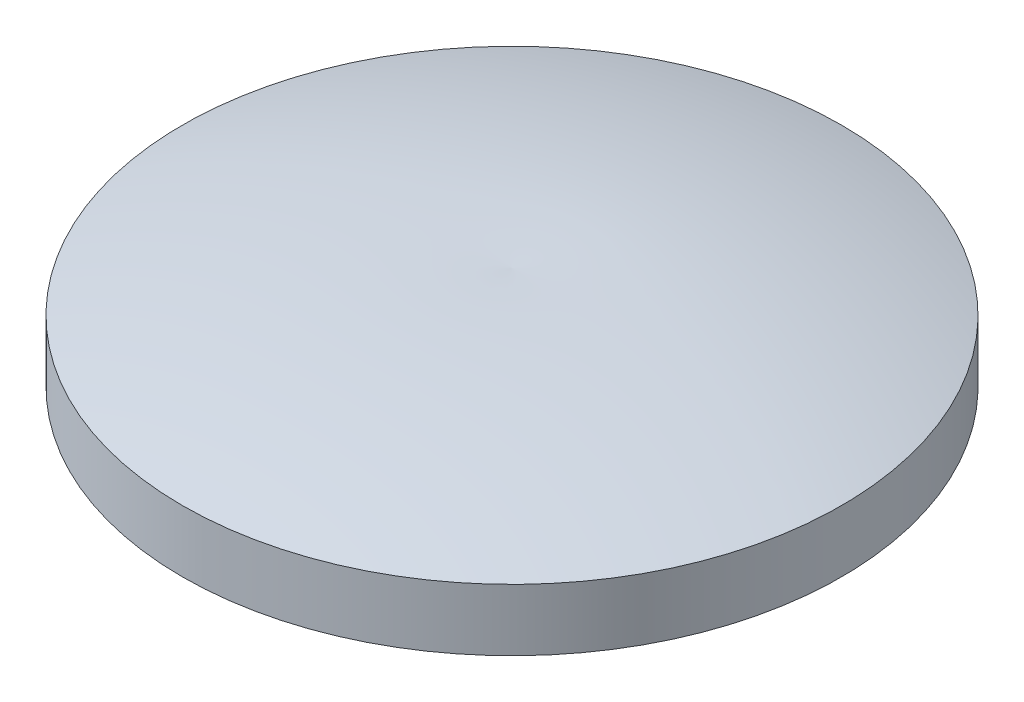
ISO-10303-21;
HEADER;
FILE_DESCRIPTION(('STEP AP214'),'2;1');
FILE_NAME('part.step','',(''),(''),'','','');
FILE_SCHEMA(('AUTOMOTIVE_DESIGN { 1 0 10303 214 1 1 1 1 }'));
ENDSEC;
DATA;
#1=APPLICATION_CONTEXT('core data for automotive mechanical design processes');
#2=APPLICATION_PROTOCOL_DEFINITION('international standard','automotive_design',2000,#1);
#3=PRODUCT_CONTEXT('',#1,'mechanical');
#4=PRODUCT('Part','Part','',(#3));
#5=PRODUCT_RELATED_PRODUCT_CATEGORY('part','',(#4));
#6=PRODUCT_DEFINITION_FORMATION('','',#4);
#7=PRODUCT_DEFINITION_CONTEXT('part definition',#1,'design');
#8=PRODUCT_DEFINITION('design','',#6,#7);
#9=PRODUCT_DEFINITION_SHAPE('','',#8);
#10=(LENGTH_UNIT() NAMED_UNIT(*) SI_UNIT(.MILLI.,.METRE.));
#11=(NAMED_UNIT(*) PLANE_ANGLE_UNIT() SI_UNIT($,.RADIAN.));
#12=(NAMED_UNIT(*) SI_UNIT($,.STERADIAN.) SOLID_ANGLE_UNIT());
#13=UNCERTAINTY_MEASURE_WITH_UNIT(LENGTH_MEASURE(1.E-05),#10,'distance_accuracy_value','');
#14=(GEOMETRIC_REPRESENTATION_CONTEXT(3) GLOBAL_UNCERTAINTY_ASSIGNED_CONTEXT((#13)) GLOBAL_UNIT_ASSIGNED_CONTEXT((#10,
#11,#12)) REPRESENTATION_CONTEXT('',''));
#15=CARTESIAN_POINT('',(0.,0.,0.));
#16=DIRECTION('',(0.,0.,1.));
#17=DIRECTION('',(1.,0.,0.));
#18=AXIS2_PLACEMENT_3D('',#15,#16,#17);
#19=CARTESIAN_POINT('',(0.,0.,0.));
#20=DIRECTION('',(0.,1.,0.));
#21=DIRECTION('',(0.,0.,1.));
#22=AXIS2_PLACEMENT_3D('',#19,#20,#21);
#23=PLANE('',#22);
#24=CARTESIAN_POINT('',(0.,0.,0.));
#25=DIRECTION('',(0.,-1.,0.));
#26=DIRECTION('',(0.,0.,-1.));
#27=AXIS2_PLACEMENT_3D('',#24,#25,#26);
#28=CIRCLE('',#27,20.32);
#29=CARTESIAN_POINT('',(0.,0.,-20.32));
#30=VERTEX_POINT('',#29);
#31=EDGE_CURVE('E11',#30,#30,#28,.T.);
#32=ORIENTED_EDGE('',*,*,#31,.T.);
#33=EDGE_LOOP('',(#32));
#34=FACE_BOUND('',#33,.T.);
#35=ADVANCED_FACE('F32',(#34),#23,.F.);
#36=CARTESIAN_POINT('',(0.,0.,0.));
#37=DIRECTION('',(0.,-1.,0.));
#38=DIRECTION('',(0.,0.,-1.));
#39=AXIS2_PLACEMENT_3D('',#36,#37,#38);
#40=CYLINDRICAL_SURFACE('',#39,20.32);
#41=ORIENTED_EDGE('',*,*,#31,.F.);
#42=EDGE_LOOP('',(#41));
#43=FACE_BOUND('',#42,.T.);
#44=CARTESIAN_POINT('',(0.,3.81,0.));
#45=DIRECTION('',(0.,-1.,0.));
#46=DIRECTION('',(0.,0.,-1.));
#47=AXIS2_PLACEMENT_3D('',#44,#45,#46);
#48=CIRCLE('',#47,20.32);
#49=CARTESIAN_POINT('',(0.,3.81,-20.32));
#50=VERTEX_POINT('',#49);
#51=EDGE_CURVE('E38',#50,#50,#48,.T.);
#52=ORIENTED_EDGE('',*,*,#51,.T.);
#53=EDGE_LOOP('',(#52));
#54=FACE_BOUND('',#53,.T.);
#55=ADVANCED_FACE('F43',(#43,#54),#40,.T.);
#56=CARTESIAN_POINT('',(0.,-50.7111181241106,-3.18611023448617));
#57=DIRECTION('',(-1.,0.,0.));
#58=DIRECTION('',(0.,0.,-1.));
#59=AXIS2_PLACEMENT_3D('',#56,#57,#58);
#60=CIRCLE('',#59,57.15);
#61=TRIMMED_CURVE('',#60,(PARAMETER_VALUE(-1.62657520663832)),
(PARAMETER_VALUE(1.62657520663832)),.T.,.PARAMETER.);
#62=CARTESIAN_POINT('',(0.,-50.7111181241106,0.));
#63=DIRECTION('',(0.,-1.,0.));
#64=AXIS1_PLACEMENT('',#62,#63);
#65=SURFACE_OF_REVOLUTION('',#61,#64);
#66=ORIENTED_EDGE('',*,*,#51,.F.);
#67=EDGE_LOOP('',(#66));
#68=FACE_BOUND('',#67,.T.);
#69=CARTESIAN_POINT('',(0.,6.35,0.));
#70=VERTEX_POINT('',#69);
#71=VERTEX_LOOP('',#70);
#72=FACE_BOUND('',#71,.T.);
#73=ADVANCED_FACE('F41',(#68,#72),#65,.T.);
#74=CLOSED_SHELL('',(#35,#55,#73));
#75=MANIFOLD_SOLID_BREP('B2',#74);
#76=ADVANCED_BREP_SHAPE_REPRESENTATION('',(#18,#75),#14);
#77=SHAPE_DEFINITION_REPRESENTATION(#9,#76);
ENDSEC;
END-ISO-10303-21;
